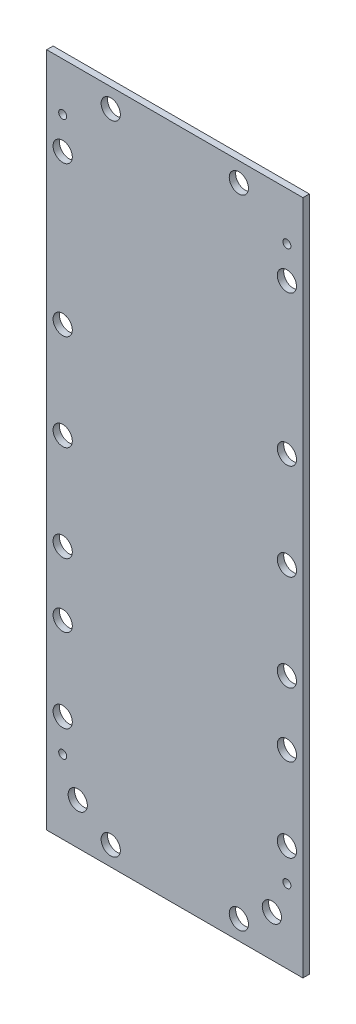
ISO-10303-21;
HEADER;
FILE_DESCRIPTION(('STEP AP214'),'2;1');
FILE_NAME('part.step','',(''),(''),'','','');
FILE_SCHEMA(('AUTOMOTIVE_DESIGN { 1 0 10303 214 1 1 1 1 }'));
ENDSEC;
DATA;
#1=APPLICATION_CONTEXT('core data for automotive mechanical design processes');
#2=APPLICATION_PROTOCOL_DEFINITION('international standard','automotive_design',2000,#1);
#3=PRODUCT_CONTEXT('',#1,'mechanical');
#4=PRODUCT('Part','Part','',(#3));
#5=PRODUCT_RELATED_PRODUCT_CATEGORY('part','',(#4));
#6=PRODUCT_DEFINITION_FORMATION('','',#4);
#7=PRODUCT_DEFINITION_CONTEXT('part definition',#1,'design');
#8=PRODUCT_DEFINITION('design','',#6,#7);
#9=PRODUCT_DEFINITION_SHAPE('','',#8);
#10=(LENGTH_UNIT() NAMED_UNIT(*) SI_UNIT(.MILLI.,.METRE.));
#11=(NAMED_UNIT(*) PLANE_ANGLE_UNIT() SI_UNIT($,.RADIAN.));
#12=(NAMED_UNIT(*) SI_UNIT($,.STERADIAN.) SOLID_ANGLE_UNIT());
#13=UNCERTAINTY_MEASURE_WITH_UNIT(LENGTH_MEASURE(1.E-05),#10,'distance_accuracy_value','');
#14=(GEOMETRIC_REPRESENTATION_CONTEXT(3) GLOBAL_UNCERTAINTY_ASSIGNED_CONTEXT((#13)) GLOBAL_UNIT_ASSIGNED_CONTEXT((#10,
#11,#12)) REPRESENTATION_CONTEXT('',''));
#15=CARTESIAN_POINT('',(0.,0.,0.));
#16=DIRECTION('',(0.,0.,1.));
#17=DIRECTION('',(1.,0.,0.));
#18=AXIS2_PLACEMENT_3D('',#15,#16,#17);
#19=CARTESIAN_POINT('',(80.,0.,2.));
#20=DIRECTION('',(0.,1.,0.));
#21=DIRECTION('',(0.,0.,1.));
#22=AXIS2_PLACEMENT_3D('',#19,#20,#21);
#23=PLANE('',#22);
#24=DIRECTION('',(1.,0.,0.));
#25=VECTOR('',#24,1.);
#26=CARTESIAN_POINT('',(80.,0.,0.));
#27=LINE('',#26,#25);
#28=CARTESIAN_POINT('',(0.,0.,0.));
#29=VERTEX_POINT('',#28);
#30=CARTESIAN_POINT('',(80.,0.,0.));
#31=VERTEX_POINT('',#30);
#32=EDGE_CURVE('E104',#29,#31,#27,.T.);
#33=ORIENTED_EDGE('',*,*,#32,.T.);
#34=DIRECTION('',(0.,0.,-1.));
#35=VECTOR('',#34,1.);
#36=CARTESIAN_POINT('',(80.,0.,2.));
#37=LINE('',#36,#35);
#38=CARTESIAN_POINT('',(80.,0.,2.));
#39=VERTEX_POINT('',#38);
#40=EDGE_CURVE('E11',#39,#31,#37,.T.);
#41=ORIENTED_EDGE('',*,*,#40,.F.);
#42=DIRECTION('',(1.,0.,0.));
#43=VECTOR('',#42,1.);
#44=CARTESIAN_POINT('',(80.,0.,2.));
#45=LINE('',#44,#43);
#46=CARTESIAN_POINT('',(0.,0.,2.));
#47=VERTEX_POINT('',#46);
#48=EDGE_CURVE('E91',#47,#39,#45,.T.);
#49=ORIENTED_EDGE('',*,*,#48,.F.);
#50=DIRECTION('',(0.,0.,-1.));
#51=VECTOR('',#50,1.);
#52=CARTESIAN_POINT('',(0.,0.,2.));
#53=LINE('',#52,#51);
#54=EDGE_CURVE('E100',#47,#29,#53,.T.);
#55=ORIENTED_EDGE('',*,*,#54,.T.);
#56=EDGE_LOOP('',(#33,#41,#49,#55));
#57=FACE_BOUND('',#56,.T.);
#58=ADVANCED_FACE('F38',(#57),#23,.F.);
#59=CARTESIAN_POINT('',(80.,211.,2.));
#60=DIRECTION('',(-1.,0.,0.));
#61=DIRECTION('',(0.,0.,1.));
#62=AXIS2_PLACEMENT_3D('',#59,#60,#61);
#63=PLANE('',#62);
#64=DIRECTION('',(0.,1.,0.));
#65=VECTOR('',#64,1.);
#66=CARTESIAN_POINT('',(80.,211.,0.));
#67=LINE('',#66,#65);
#68=CARTESIAN_POINT('',(80.,211.,0.));
#69=VERTEX_POINT('',#68);
#70=EDGE_CURVE('E95',#31,#69,#67,.T.);
#71=ORIENTED_EDGE('',*,*,#70,.T.);
#72=DIRECTION('',(0.,0.,-1.));
#73=VECTOR('',#72,1.);
#74=CARTESIAN_POINT('',(80.,211.,2.));
#75=LINE('',#74,#73);
#76=CARTESIAN_POINT('',(80.,211.,2.));
#77=VERTEX_POINT('',#76);
#78=EDGE_CURVE('E47',#77,#69,#75,.T.);
#79=ORIENTED_EDGE('',*,*,#78,.F.);
#80=DIRECTION('',(0.,1.,0.));
#81=VECTOR('',#80,1.);
#82=CARTESIAN_POINT('',(80.,211.,2.));
#83=LINE('',#82,#81);
#84=EDGE_CURVE('E86',#39,#77,#83,.T.);
#85=ORIENTED_EDGE('',*,*,#84,.F.);
#86=ORIENTED_EDGE('',*,*,#40,.T.);
#87=EDGE_LOOP('',(#71,#79,#85,#86));
#88=FACE_BOUND('',#87,.T.);
#89=ADVANCED_FACE('F94',(#88),#63,.F.);
#90=CARTESIAN_POINT('',(0.,211.,2.));
#91=DIRECTION('',(0.,-1.,0.));
#92=DIRECTION('',(0.,0.,-1.));
#93=AXIS2_PLACEMENT_3D('',#90,#91,#92);
#94=PLANE('',#93);
#95=DIRECTION('',(-1.,0.,0.));
#96=VECTOR('',#95,1.);
#97=CARTESIAN_POINT('',(0.,211.,0.));
#98=LINE('',#97,#96);
#99=CARTESIAN_POINT('',(0.,211.,0.));
#100=VERTEX_POINT('',#99);
#101=EDGE_CURVE('E73',#69,#100,#98,.T.);
#102=ORIENTED_EDGE('',*,*,#101,.T.);
#103=DIRECTION('',(0.,0.,-1.));
#104=VECTOR('',#103,1.);
#105=CARTESIAN_POINT('',(0.,211.,2.));
#106=LINE('',#105,#104);
#107=CARTESIAN_POINT('',(0.,211.,2.));
#108=VERTEX_POINT('',#107);
#109=EDGE_CURVE('E96',#108,#100,#106,.T.);
#110=ORIENTED_EDGE('',*,*,#109,.F.);
#111=DIRECTION('',(-1.,0.,0.));
#112=VECTOR('',#111,1.);
#113=CARTESIAN_POINT('',(0.,211.,2.));
#114=LINE('',#113,#112);
#115=EDGE_CURVE('E89',#77,#108,#114,.T.);
#116=ORIENTED_EDGE('',*,*,#115,.F.);
#117=ORIENTED_EDGE('',*,*,#78,.T.);
#118=EDGE_LOOP('',(#102,#110,#116,#117));
#119=FACE_BOUND('',#118,.T.);
#120=ADVANCED_FACE('F98',(#119),#94,.F.);
#121=CARTESIAN_POINT('',(0.,0.,2.));
#122=DIRECTION('',(1.,0.,0.));
#123=DIRECTION('',(0.,0.,-1.));
#124=AXIS2_PLACEMENT_3D('',#121,#122,#123);
#125=PLANE('',#124);
#126=DIRECTION('',(0.,-1.,0.));
#127=VECTOR('',#126,1.);
#128=CARTESIAN_POINT('',(0.,0.,0.));
#129=LINE('',#128,#127);
#130=EDGE_CURVE('E79',#100,#29,#129,.T.);
#131=ORIENTED_EDGE('',*,*,#130,.T.);
#132=ORIENTED_EDGE('',*,*,#54,.F.);
#133=DIRECTION('',(0.,-1.,0.));
#134=VECTOR('',#133,1.);
#135=CARTESIAN_POINT('',(0.,0.,2.));
#136=LINE('',#135,#134);
#137=EDGE_CURVE('E56',#108,#47,#136,.T.);
#138=ORIENTED_EDGE('',*,*,#137,.F.);
#139=ORIENTED_EDGE('',*,*,#109,.T.);
#140=EDGE_LOOP('',(#131,#132,#138,#139));
#141=FACE_BOUND('',#140,.T.);
#142=ADVANCED_FACE('F156',(#141),#125,.F.);
#143=CARTESIAN_POINT('',(0.,0.,2.));
#144=DIRECTION('',(0.,0.,-1.));
#145=DIRECTION('',(-1.,0.,0.));
#146=AXIS2_PLACEMENT_3D('',#143,#144,#145);
#147=PLANE('',#146);
#148=CARTESIAN_POINT('',(20.,205.,2.));
#149=DIRECTION('',(0.,0.,-1.));
#150=DIRECTION('',(-1.,0.,0.));
#151=AXIS2_PLACEMENT_3D('',#148,#149,#150);
#152=CIRCLE('',#151,3.);
#153=CARTESIAN_POINT('',(17.,205.,2.));
#154=VERTEX_POINT('',#153);
#155=EDGE_CURVE('E407',#154,#154,#152,.F.);
#156=ORIENTED_EDGE('',*,*,#155,.F.);
#157=EDGE_LOOP('',(#156));
#158=FACE_BOUND('',#157,.T.);
#159=CARTESIAN_POINT('',(4.99999999999998,33.2,2.));
#160=DIRECTION('',(0.,0.,-1.));
#161=DIRECTION('',(-1.,0.,0.));
#162=AXIS2_PLACEMENT_3D('',#159,#160,#161);
#163=CIRCLE('',#162,3.);
#164=CARTESIAN_POINT('',(1.99999999999998,33.2,2.));
#165=VERTEX_POINT('',#164);
#166=EDGE_CURVE('E419',#165,#165,#163,.F.);
#167=ORIENTED_EDGE('',*,*,#166,.F.);
#168=EDGE_LOOP('',(#167));
#169=FACE_BOUND('',#168,.T.);
#170=CARTESIAN_POINT('',(4.99999999999999,59.2,2.));
#171=DIRECTION('',(0.,0.,-1.));
#172=DIRECTION('',(-1.,0.,0.));
#173=AXIS2_PLACEMENT_3D('',#170,#171,#172);
#174=CIRCLE('',#173,3.);
#175=CARTESIAN_POINT('',(1.99999999999998,59.2,2.));
#176=VERTEX_POINT('',#175);
#177=EDGE_CURVE('E426',#176,#176,#174,.F.);
#178=ORIENTED_EDGE('',*,*,#177,.F.);
#179=EDGE_LOOP('',(#178));
#180=FACE_BOUND('',#179,.T.);
#181=CARTESIAN_POINT('',(5.00000000000002,79.2,2.));
#182=DIRECTION('',(0.,0.,-1.));
#183=DIRECTION('',(-1.,0.,0.));
#184=AXIS2_PLACEMENT_3D('',#181,#182,#183);
#185=CIRCLE('',#184,3.);
#186=CARTESIAN_POINT('',(2.00000000000001,79.2,2.));
#187=VERTEX_POINT('',#186);
#188=EDGE_CURVE('E425',#187,#187,#185,.F.);
#189=ORIENTED_EDGE('',*,*,#188,.F.);
#190=EDGE_LOOP('',(#189));
#191=FACE_BOUND('',#190,.T.);
#192=CARTESIAN_POINT('',(60.,5.99999999999999,2.));
#193=DIRECTION('',(0.,0.,-1.));
#194=DIRECTION('',(-1.,0.,0.));
#195=AXIS2_PLACEMENT_3D('',#192,#193,#194);
#196=CIRCLE('',#195,3.);
#197=CARTESIAN_POINT('',(57.,5.99999999999999,2.));
#198=VERTEX_POINT('',#197);
#199=EDGE_CURVE('E411',#198,#198,#196,.F.);
#200=ORIENTED_EDGE('',*,*,#199,.F.);
#201=EDGE_LOOP('',(#200));
#202=FACE_BOUND('',#201,.T.);
#203=CARTESIAN_POINT('',(20.,5.99999999999999,2.));
#204=DIRECTION('',(0.,0.,-1.));
#205=DIRECTION('',(-1.,0.,0.));
#206=AXIS2_PLACEMENT_3D('',#203,#204,#205);
#207=CIRCLE('',#206,2.99999999999999);
#208=CARTESIAN_POINT('',(17.,5.99999999999999,2.));
#209=VERTEX_POINT('',#208);
#210=EDGE_CURVE('E535',#209,#209,#207,.F.);
#211=ORIENTED_EDGE('',*,*,#210,.F.);
#212=EDGE_LOOP('',(#211));
#213=FACE_BOUND('',#212,.T.);
#214=CARTESIAN_POINT('',(70.3,13.,2.));
#215=DIRECTION('',(0.,0.,-1.));
#216=DIRECTION('',(-1.,0.,0.));
#217=AXIS2_PLACEMENT_3D('',#214,#215,#216);
#218=CIRCLE('',#217,3.00000000000001);
#219=CARTESIAN_POINT('',(67.3,13.,2.));
#220=VERTEX_POINT('',#219);
#221=EDGE_CURVE('E540',#220,#220,#218,.F.);
#222=ORIENTED_EDGE('',*,*,#221,.F.);
#223=EDGE_LOOP('',(#222));
#224=FACE_BOUND('',#223,.T.);
#225=CARTESIAN_POINT('',(60.,205.,2.));
#226=DIRECTION('',(0.,0.,-1.));
#227=DIRECTION('',(-1.,0.,0.));
#228=AXIS2_PLACEMENT_3D('',#225,#226,#227);
#229=CIRCLE('',#228,3.);
#230=CARTESIAN_POINT('',(57.,205.,2.));
#231=VERTEX_POINT('',#230);
#232=EDGE_CURVE('E529',#231,#231,#229,.F.);
#233=ORIENTED_EDGE('',*,*,#232,.F.);
#234=EDGE_LOOP('',(#233));
#235=FACE_BOUND('',#234,.T.);
#236=CARTESIAN_POINT('',(75.,139.2,2.));
#237=DIRECTION('',(0.,0.,-1.));
#238=DIRECTION('',(-1.,0.,0.));
#239=AXIS2_PLACEMENT_3D('',#236,#237,#238);
#240=CIRCLE('',#239,3.00000000000001);
#241=CARTESIAN_POINT('',(72.,139.2,2.));
#242=VERTEX_POINT('',#241);
#243=EDGE_CURVE('E462',#242,#242,#240,.F.);
#244=ORIENTED_EDGE('',*,*,#243,.F.);
#245=EDGE_LOOP('',(#244));
#246=FACE_BOUND('',#245,.T.);
#247=CARTESIAN_POINT('',(75.,109.2,2.));
#248=DIRECTION('',(0.,0.,-1.));
#249=DIRECTION('',(-1.,0.,0.));
#250=AXIS2_PLACEMENT_3D('',#247,#248,#249);
#251=CIRCLE('',#250,3.00000000000001);
#252=CARTESIAN_POINT('',(72.,109.2,2.));
#253=VERTEX_POINT('',#252);
#254=EDGE_CURVE('E463',#253,#253,#251,.F.);
#255=ORIENTED_EDGE('',*,*,#254,.F.);
#256=EDGE_LOOP('',(#255));
#257=FACE_BOUND('',#256,.T.);
#258=CARTESIAN_POINT('',(75.,79.2,2.));
#259=DIRECTION('',(0.,0.,-1.));
#260=DIRECTION('',(-1.,0.,0.));
#261=AXIS2_PLACEMENT_3D('',#258,#259,#260);
#262=CIRCLE('',#261,3.00000000000001);
#263=CARTESIAN_POINT('',(72.,79.2,2.));
#264=VERTEX_POINT('',#263);
#265=EDGE_CURVE('E470',#264,#264,#262,.F.);
#266=ORIENTED_EDGE('',*,*,#265,.F.);
#267=EDGE_LOOP('',(#266));
#268=FACE_BOUND('',#267,.T.);
#269=CARTESIAN_POINT('',(75.,59.2,2.));
#270=DIRECTION('',(0.,0.,-1.));
#271=DIRECTION('',(-1.,0.,0.));
#272=AXIS2_PLACEMENT_3D('',#269,#270,#271);
#273=CIRCLE('',#272,3.00000000000001);
#274=CARTESIAN_POINT('',(72.,59.2,2.));
#275=VERTEX_POINT('',#274);
#276=EDGE_CURVE('E476',#275,#275,#273,.F.);
#277=ORIENTED_EDGE('',*,*,#276,.F.);
#278=EDGE_LOOP('',(#277));
#279=FACE_BOUND('',#278,.T.);
#280=CARTESIAN_POINT('',(5.00000000000002,109.2,2.));
#281=DIRECTION('',(0.,0.,-1.));
#282=DIRECTION('',(-1.,0.,0.));
#283=AXIS2_PLACEMENT_3D('',#280,#281,#282);
#284=CIRCLE('',#283,3.);
#285=CARTESIAN_POINT('',(2.00000000000002,109.2,2.));
#286=VERTEX_POINT('',#285);
#287=EDGE_CURVE('E439',#286,#286,#284,.F.);
#288=ORIENTED_EDGE('',*,*,#287,.F.);
#289=EDGE_LOOP('',(#288));
#290=FACE_BOUND('',#289,.T.);
#291=CARTESIAN_POINT('',(5.00000000000002,139.2,2.));
#292=DIRECTION('',(0.,0.,-1.));
#293=DIRECTION('',(-1.,0.,0.));
#294=AXIS2_PLACEMENT_3D('',#291,#292,#293);
#295=CIRCLE('',#294,3.);
#296=CARTESIAN_POINT('',(2.00000000000002,139.2,2.));
#297=VERTEX_POINT('',#296);
#298=EDGE_CURVE('E438',#297,#297,#295,.F.);
#299=ORIENTED_EDGE('',*,*,#298,.F.);
#300=EDGE_LOOP('',(#299));
#301=FACE_BOUND('',#300,.T.);
#302=CARTESIAN_POINT('',(5.00000000000003,186.,2.));
#303=DIRECTION('',(0.,0.,-1.));
#304=DIRECTION('',(-1.,0.,0.));
#305=AXIS2_PLACEMENT_3D('',#302,#303,#304);
#306=CIRCLE('',#305,3.);
#307=CARTESIAN_POINT('',(2.00000000000003,186.,2.));
#308=VERTEX_POINT('',#307);
#309=EDGE_CURVE('E451',#308,#308,#306,.F.);
#310=ORIENTED_EDGE('',*,*,#309,.F.);
#311=EDGE_LOOP('',(#310));
#312=FACE_BOUND('',#311,.T.);
#313=CARTESIAN_POINT('',(75.,33.2,2.));
#314=DIRECTION('',(0.,0.,-1.));
#315=DIRECTION('',(-1.,0.,0.));
#316=AXIS2_PLACEMENT_3D('',#313,#314,#315);
#317=CIRCLE('',#316,3.00000000000001);
#318=CARTESIAN_POINT('',(72.,33.2,2.));
#319=VERTEX_POINT('',#318);
#320=EDGE_CURVE('E450',#319,#319,#317,.F.);
#321=ORIENTED_EDGE('',*,*,#320,.F.);
#322=EDGE_LOOP('',(#321));
#323=FACE_BOUND('',#322,.T.);
#324=CARTESIAN_POINT('',(9.7,13.,2.));
#325=DIRECTION('',(0.,0.,-1.));
#326=DIRECTION('',(-1.,0.,0.));
#327=AXIS2_PLACEMENT_3D('',#324,#325,#326);
#328=CIRCLE('',#327,3.);
#329=CARTESIAN_POINT('',(6.7,13.,2.));
#330=VERTEX_POINT('',#329);
#331=EDGE_CURVE('E524',#330,#330,#328,.F.);
#332=ORIENTED_EDGE('',*,*,#331,.F.);
#333=EDGE_LOOP('',(#332));
#334=FACE_BOUND('',#333,.T.);
#335=CARTESIAN_POINT('',(75.,186.,2.));
#336=DIRECTION('',(0.,0.,-1.));
#337=DIRECTION('',(-1.,0.,0.));
#338=AXIS2_PLACEMENT_3D('',#335,#336,#337);
#339=CIRCLE('',#338,3.00000000000001);
#340=CARTESIAN_POINT('',(72.,186.,2.));
#341=VERTEX_POINT('',#340);
#342=EDGE_CURVE('E485',#341,#341,#339,.F.);
#343=ORIENTED_EDGE('',*,*,#342,.F.);
#344=EDGE_LOOP('',(#343));
#345=FACE_BOUND('',#344,.T.);
#346=CARTESIAN_POINT('',(75.,196.,2.));
#347=DIRECTION('',(0.,0.,-1.));
#348=DIRECTION('',(-1.,0.,0.));
#349=AXIS2_PLACEMENT_3D('',#346,#347,#348);
#350=CIRCLE('',#349,1.25);
#351=CARTESIAN_POINT('',(73.75,196.,2.));
#352=VERTEX_POINT('',#351);
#353=EDGE_CURVE('E41',#352,#352,#350,.T.);
#354=ORIENTED_EDGE('',*,*,#353,.T.);
#355=EDGE_LOOP('',(#354));
#356=FACE_BOUND('',#355,.T.);
#357=CARTESIAN_POINT('',(5.00000000000003,196.,2.));
#358=DIRECTION('',(0.,0.,-1.));
#359=DIRECTION('',(-1.,0.,0.));
#360=AXIS2_PLACEMENT_3D('',#357,#358,#359);
#361=CIRCLE('',#360,1.25);
#362=CARTESIAN_POINT('',(3.75000000000003,196.,2.));
#363=VERTEX_POINT('',#362);
#364=EDGE_CURVE('E121',#363,#363,#361,.T.);
#365=ORIENTED_EDGE('',*,*,#364,.T.);
#366=EDGE_LOOP('',(#365));
#367=FACE_BOUND('',#366,.T.);
#368=CARTESIAN_POINT('',(75.,23.,2.));
#369=DIRECTION('',(0.,0.,-1.));
#370=DIRECTION('',(-1.,0.,0.));
#371=AXIS2_PLACEMENT_3D('',#368,#369,#370);
#372=CIRCLE('',#371,1.25);
#373=CARTESIAN_POINT('',(73.75,23.,2.));
#374=VERTEX_POINT('',#373);
#375=EDGE_CURVE('E112',#374,#374,#372,.T.);
#376=ORIENTED_EDGE('',*,*,#375,.T.);
#377=EDGE_LOOP('',(#376));
#378=FACE_BOUND('',#377,.T.);
#379=CARTESIAN_POINT('',(5.00000000000003,23.,2.));
#380=DIRECTION('',(0.,0.,-1.));
#381=DIRECTION('',(-1.,0.,0.));
#382=AXIS2_PLACEMENT_3D('',#379,#380,#381);
#383=CIRCLE('',#382,1.25);
#384=CARTESIAN_POINT('',(3.75000000000003,23.,2.));
#385=VERTEX_POINT('',#384);
#386=EDGE_CURVE('E107',#385,#385,#383,.T.);
#387=ORIENTED_EDGE('',*,*,#386,.T.);
#388=EDGE_LOOP('',(#387));
#389=FACE_BOUND('',#388,.T.);
#390=ORIENTED_EDGE('',*,*,#48,.T.);
#391=ORIENTED_EDGE('',*,*,#84,.T.);
#392=ORIENTED_EDGE('',*,*,#115,.T.);
#393=ORIENTED_EDGE('',*,*,#137,.T.);
#394=EDGE_LOOP('',(#390,#391,#392,#393));
#395=FACE_BOUND('',#394,.T.);
#396=ADVANCED_FACE('F87',(#158,#169,#180,#191,#202,#213,#224,#235,#246,#257,#268,#279,#290,#301,
#312,#323,#334,#345,#356,#367,#378,#389,#395),#147,.F.);
#397=CARTESIAN_POINT('',(0.,0.,0.));
#398=DIRECTION('',(0.,0.,-1.));
#399=DIRECTION('',(-1.,0.,0.));
#400=AXIS2_PLACEMENT_3D('',#397,#398,#399);
#401=PLANE('',#400);
#402=CARTESIAN_POINT('',(20.,205.,0.));
#403=DIRECTION('',(0.,0.,-1.));
#404=DIRECTION('',(-1.,0.,0.));
#405=AXIS2_PLACEMENT_3D('',#402,#403,#404);
#406=CIRCLE('',#405,3.);
#407=CARTESIAN_POINT('',(17.,205.,0.));
#408=VERTEX_POINT('',#407);
#409=EDGE_CURVE('E410',#408,#408,#406,.T.);
#410=ORIENTED_EDGE('',*,*,#409,.F.);
#411=EDGE_LOOP('',(#410));
#412=FACE_BOUND('',#411,.T.);
#413=CARTESIAN_POINT('',(4.99999999999998,33.2,0.));
#414=DIRECTION('',(0.,0.,-1.));
#415=DIRECTION('',(-1.,0.,0.));
#416=AXIS2_PLACEMENT_3D('',#413,#414,#415);
#417=CIRCLE('',#416,3.);
#418=CARTESIAN_POINT('',(1.99999999999998,33.2,0.));
#419=VERTEX_POINT('',#418);
#420=EDGE_CURVE('E413',#419,#419,#417,.T.);
#421=ORIENTED_EDGE('',*,*,#420,.F.);
#422=EDGE_LOOP('',(#421));
#423=FACE_BOUND('',#422,.T.);
#424=CARTESIAN_POINT('',(4.99999999999999,59.2,0.));
#425=DIRECTION('',(0.,0.,-1.));
#426=DIRECTION('',(-1.,0.,0.));
#427=AXIS2_PLACEMENT_3D('',#424,#425,#426);
#428=CIRCLE('',#427,3.);
#429=CARTESIAN_POINT('',(1.99999999999998,59.2,0.));
#430=VERTEX_POINT('',#429);
#431=EDGE_CURVE('E430',#430,#430,#428,.T.);
#432=ORIENTED_EDGE('',*,*,#431,.F.);
#433=EDGE_LOOP('',(#432));
#434=FACE_BOUND('',#433,.T.);
#435=CARTESIAN_POINT('',(5.00000000000002,79.2,0.));
#436=DIRECTION('',(0.,0.,-1.));
#437=DIRECTION('',(-1.,0.,0.));
#438=AXIS2_PLACEMENT_3D('',#435,#436,#437);
#439=CIRCLE('',#438,3.);
#440=CARTESIAN_POINT('',(2.00000000000001,79.2,0.));
#441=VERTEX_POINT('',#440);
#442=EDGE_CURVE('E422',#441,#441,#439,.T.);
#443=ORIENTED_EDGE('',*,*,#442,.F.);
#444=EDGE_LOOP('',(#443));
#445=FACE_BOUND('',#444,.T.);
#446=CARTESIAN_POINT('',(60.,5.99999999999999,0.));
#447=DIRECTION('',(0.,0.,-1.));
#448=DIRECTION('',(-1.,0.,0.));
#449=AXIS2_PLACEMENT_3D('',#446,#447,#448);
#450=CIRCLE('',#449,3.);
#451=CARTESIAN_POINT('',(57.,5.99999999999999,0.));
#452=VERTEX_POINT('',#451);
#453=EDGE_CURVE('E416',#452,#452,#450,.T.);
#454=ORIENTED_EDGE('',*,*,#453,.F.);
#455=EDGE_LOOP('',(#454));
#456=FACE_BOUND('',#455,.T.);
#457=CARTESIAN_POINT('',(20.,5.99999999999999,0.));
#458=DIRECTION('',(0.,0.,-1.));
#459=DIRECTION('',(-1.,0.,0.));
#460=AXIS2_PLACEMENT_3D('',#457,#458,#459);
#461=CIRCLE('',#460,2.99999999999999);
#462=CARTESIAN_POINT('',(17.,5.99999999999999,0.));
#463=VERTEX_POINT('',#462);
#464=EDGE_CURVE('E537',#463,#463,#461,.T.);
#465=ORIENTED_EDGE('',*,*,#464,.F.);
#466=EDGE_LOOP('',(#465));
#467=FACE_BOUND('',#466,.T.);
#468=CARTESIAN_POINT('',(70.3,13.,0.));
#469=DIRECTION('',(0.,0.,-1.));
#470=DIRECTION('',(-1.,0.,0.));
#471=AXIS2_PLACEMENT_3D('',#468,#469,#470);
#472=CIRCLE('',#471,3.00000000000001);
#473=CARTESIAN_POINT('',(67.3,13.,0.));
#474=VERTEX_POINT('',#473);
#475=EDGE_CURVE('E543',#474,#474,#472,.T.);
#476=ORIENTED_EDGE('',*,*,#475,.F.);
#477=EDGE_LOOP('',(#476));
#478=FACE_BOUND('',#477,.T.);
#479=CARTESIAN_POINT('',(60.,205.,0.));
#480=DIRECTION('',(0.,0.,-1.));
#481=DIRECTION('',(-1.,0.,0.));
#482=AXIS2_PLACEMENT_3D('',#479,#480,#481);
#483=CIRCLE('',#482,3.);
#484=CARTESIAN_POINT('',(57.,205.,0.));
#485=VERTEX_POINT('',#484);
#486=EDGE_CURVE('E525',#485,#485,#483,.T.);
#487=ORIENTED_EDGE('',*,*,#486,.F.);
#488=EDGE_LOOP('',(#487));
#489=FACE_BOUND('',#488,.T.);
#490=CARTESIAN_POINT('',(75.,139.2,0.));
#491=DIRECTION('',(0.,0.,-1.));
#492=DIRECTION('',(-1.,0.,0.));
#493=AXIS2_PLACEMENT_3D('',#490,#491,#492);
#494=CIRCLE('',#493,3.00000000000001);
#495=CARTESIAN_POINT('',(72.,139.2,0.));
#496=VERTEX_POINT('',#495);
#497=EDGE_CURVE('E459',#496,#496,#494,.T.);
#498=ORIENTED_EDGE('',*,*,#497,.F.);
#499=EDGE_LOOP('',(#498));
#500=FACE_BOUND('',#499,.T.);
#501=CARTESIAN_POINT('',(75.,109.2,0.));
#502=DIRECTION('',(0.,0.,-1.));
#503=DIRECTION('',(-1.,0.,0.));
#504=AXIS2_PLACEMENT_3D('',#501,#502,#503);
#505=CIRCLE('',#504,3.00000000000001);
#506=CARTESIAN_POINT('',(72.,109.2,0.));
#507=VERTEX_POINT('',#506);
#508=EDGE_CURVE('E467',#507,#507,#505,.T.);
#509=ORIENTED_EDGE('',*,*,#508,.F.);
#510=EDGE_LOOP('',(#509));
#511=FACE_BOUND('',#510,.T.);
#512=CARTESIAN_POINT('',(75.,79.2,0.));
#513=DIRECTION('',(0.,0.,-1.));
#514=DIRECTION('',(-1.,0.,0.));
#515=AXIS2_PLACEMENT_3D('',#512,#513,#514);
#516=CIRCLE('',#515,3.00000000000001);
#517=CARTESIAN_POINT('',(72.,79.2,0.));
#518=VERTEX_POINT('',#517);
#519=EDGE_CURVE('E473',#518,#518,#516,.T.);
#520=ORIENTED_EDGE('',*,*,#519,.F.);
#521=EDGE_LOOP('',(#520));
#522=FACE_BOUND('',#521,.T.);
#523=CARTESIAN_POINT('',(75.,59.2,0.));
#524=DIRECTION('',(0.,0.,-1.));
#525=DIRECTION('',(-1.,0.,0.));
#526=AXIS2_PLACEMENT_3D('',#523,#524,#525);
#527=CIRCLE('',#526,3.00000000000001);
#528=CARTESIAN_POINT('',(72.,59.2,0.));
#529=VERTEX_POINT('',#528);
#530=EDGE_CURVE('E454',#529,#529,#527,.T.);
#531=ORIENTED_EDGE('',*,*,#530,.F.);
#532=EDGE_LOOP('',(#531));
#533=FACE_BOUND('',#532,.T.);
#534=CARTESIAN_POINT('',(5.00000000000002,109.2,0.));
#535=DIRECTION('',(0.,0.,-1.));
#536=DIRECTION('',(-1.,0.,0.));
#537=AXIS2_PLACEMENT_3D('',#534,#535,#536);
#538=CIRCLE('',#537,3.);
#539=CARTESIAN_POINT('',(2.00000000000002,109.2,0.));
#540=VERTEX_POINT('',#539);
#541=EDGE_CURVE('E429',#540,#540,#538,.T.);
#542=ORIENTED_EDGE('',*,*,#541,.F.);
#543=EDGE_LOOP('',(#542));
#544=FACE_BOUND('',#543,.T.);
#545=CARTESIAN_POINT('',(5.00000000000002,139.2,0.));
#546=DIRECTION('',(0.,0.,-1.));
#547=DIRECTION('',(-1.,0.,0.));
#548=AXIS2_PLACEMENT_3D('',#545,#546,#547);
#549=CIRCLE('',#548,3.);
#550=CARTESIAN_POINT('',(2.00000000000002,139.2,0.));
#551=VERTEX_POINT('',#550);
#552=EDGE_CURVE('E435',#551,#551,#549,.T.);
#553=ORIENTED_EDGE('',*,*,#552,.F.);
#554=EDGE_LOOP('',(#553));
#555=FACE_BOUND('',#554,.T.);
#556=CARTESIAN_POINT('',(5.00000000000003,186.,0.));
#557=DIRECTION('',(0.,0.,-1.));
#558=DIRECTION('',(-1.,0.,0.));
#559=AXIS2_PLACEMENT_3D('',#556,#557,#558);
#560=CIRCLE('',#559,3.);
#561=CARTESIAN_POINT('',(2.00000000000003,186.,0.));
#562=VERTEX_POINT('',#561);
#563=EDGE_CURVE('E442',#562,#562,#560,.T.);
#564=ORIENTED_EDGE('',*,*,#563,.F.);
#565=EDGE_LOOP('',(#564));
#566=FACE_BOUND('',#565,.T.);
#567=CARTESIAN_POINT('',(75.,33.2,0.));
#568=DIRECTION('',(0.,0.,-1.));
#569=DIRECTION('',(-1.,0.,0.));
#570=AXIS2_PLACEMENT_3D('',#567,#568,#569);
#571=CIRCLE('',#570,3.00000000000001);
#572=CARTESIAN_POINT('',(72.,33.2,0.));
#573=VERTEX_POINT('',#572);
#574=EDGE_CURVE('E447',#573,#573,#571,.T.);
#575=ORIENTED_EDGE('',*,*,#574,.F.);
#576=EDGE_LOOP('',(#575));
#577=FACE_BOUND('',#576,.T.);
#578=CARTESIAN_POINT('',(9.7,13.,0.));
#579=DIRECTION('',(0.,0.,-1.));
#580=DIRECTION('',(-1.,0.,0.));
#581=AXIS2_PLACEMENT_3D('',#578,#579,#580);
#582=CIRCLE('',#581,3.);
#583=CARTESIAN_POINT('',(6.7,13.,0.));
#584=VERTEX_POINT('',#583);
#585=EDGE_CURVE('E526',#584,#584,#582,.T.);
#586=ORIENTED_EDGE('',*,*,#585,.F.);
#587=EDGE_LOOP('',(#586));
#588=FACE_BOUND('',#587,.T.);
#589=CARTESIAN_POINT('',(75.,186.,0.));
#590=DIRECTION('',(0.,0.,-1.));
#591=DIRECTION('',(-1.,0.,0.));
#592=AXIS2_PLACEMENT_3D('',#589,#590,#591);
#593=CIRCLE('',#592,3.00000000000001);
#594=CARTESIAN_POINT('',(72.,186.,0.));
#595=VERTEX_POINT('',#594);
#596=EDGE_CURVE('E466',#595,#595,#593,.T.);
#597=ORIENTED_EDGE('',*,*,#596,.F.);
#598=EDGE_LOOP('',(#597));
#599=FACE_BOUND('',#598,.T.);
#600=CARTESIAN_POINT('',(75.,196.,0.));
#601=DIRECTION('',(0.,0.,-1.));
#602=DIRECTION('',(-1.,0.,0.));
#603=AXIS2_PLACEMENT_3D('',#600,#601,#602);
#604=CIRCLE('',#603,1.25);
#605=CARTESIAN_POINT('',(73.75,196.,0.));
#606=VERTEX_POINT('',#605);
#607=EDGE_CURVE('E488',#606,#606,#604,.T.);
#608=ORIENTED_EDGE('',*,*,#607,.F.);
#609=EDGE_LOOP('',(#608));
#610=FACE_BOUND('',#609,.T.);
#611=CARTESIAN_POINT('',(5.00000000000003,196.,0.));
#612=DIRECTION('',(0.,0.,-1.));
#613=DIRECTION('',(-1.,0.,0.));
#614=AXIS2_PLACEMENT_3D('',#611,#612,#613);
#615=CIRCLE('',#614,1.25);
#616=CARTESIAN_POINT('',(3.75000000000003,196.,0.));
#617=VERTEX_POINT('',#616);
#618=EDGE_CURVE('E126',#617,#617,#615,.T.);
#619=ORIENTED_EDGE('',*,*,#618,.F.);
#620=EDGE_LOOP('',(#619));
#621=FACE_BOUND('',#620,.T.);
#622=CARTESIAN_POINT('',(75.,23.,0.));
#623=DIRECTION('',(0.,0.,-1.));
#624=DIRECTION('',(-1.,0.,0.));
#625=AXIS2_PLACEMENT_3D('',#622,#623,#624);
#626=CIRCLE('',#625,1.25);
#627=CARTESIAN_POINT('',(73.75,23.,0.));
#628=VERTEX_POINT('',#627);
#629=EDGE_CURVE('E115',#628,#628,#626,.T.);
#630=ORIENTED_EDGE('',*,*,#629,.F.);
#631=EDGE_LOOP('',(#630));
#632=FACE_BOUND('',#631,.T.);
#633=CARTESIAN_POINT('',(5.00000000000003,23.,0.));
#634=DIRECTION('',(0.,0.,-1.));
#635=DIRECTION('',(-1.,0.,0.));
#636=AXIS2_PLACEMENT_3D('',#633,#634,#635);
#637=CIRCLE('',#636,1.25);
#638=CARTESIAN_POINT('',(3.75000000000003,23.,0.));
#639=VERTEX_POINT('',#638);
#640=EDGE_CURVE('E114',#639,#639,#637,.T.);
#641=ORIENTED_EDGE('',*,*,#640,.F.);
#642=EDGE_LOOP('',(#641));
#643=FACE_BOUND('',#642,.T.);
#644=ORIENTED_EDGE('',*,*,#32,.F.);
#645=ORIENTED_EDGE('',*,*,#130,.F.);
#646=ORIENTED_EDGE('',*,*,#101,.F.);
#647=ORIENTED_EDGE('',*,*,#70,.F.);
#648=EDGE_LOOP('',(#644,#645,#646,#647));
#649=FACE_BOUND('',#648,.T.);
#650=ADVANCED_FACE('F137',(#412,#423,#434,#445,#456,#467,#478,#489,#500,#511,#522,#533,#544,
#555,#566,#577,#588,#599,#610,#621,#632,#643,#649),#401,.T.);
#651=CARTESIAN_POINT('',(5.00000000000003,23.,0.));
#652=DIRECTION('',(0.,0.,-1.));
#653=DIRECTION('',(-1.,0.,0.));
#654=AXIS2_PLACEMENT_3D('',#651,#652,#653);
#655=CYLINDRICAL_SURFACE('',#654,1.25);
#656=ORIENTED_EDGE('',*,*,#640,.T.);
#657=EDGE_LOOP('',(#656));
#658=FACE_BOUND('',#657,.T.);
#659=ORIENTED_EDGE('',*,*,#386,.F.);
#660=EDGE_LOOP('',(#659));
#661=FACE_BOUND('',#660,.T.);
#662=ADVANCED_FACE('F134',(#658,#661),#655,.F.);
#663=CARTESIAN_POINT('',(75.,23.,0.));
#664=DIRECTION('',(0.,0.,-1.));
#665=DIRECTION('',(-1.,0.,0.));
#666=AXIS2_PLACEMENT_3D('',#663,#664,#665);
#667=CYLINDRICAL_SURFACE('',#666,1.25);
#668=ORIENTED_EDGE('',*,*,#629,.T.);
#669=EDGE_LOOP('',(#668));
#670=FACE_BOUND('',#669,.T.);
#671=ORIENTED_EDGE('',*,*,#375,.F.);
#672=EDGE_LOOP('',(#671));
#673=FACE_BOUND('',#672,.T.);
#674=ADVANCED_FACE('F136',(#670,#673),#667,.F.);
#675=CARTESIAN_POINT('',(5.00000000000003,196.,0.));
#676=DIRECTION('',(0.,0.,-1.));
#677=DIRECTION('',(-1.,0.,0.));
#678=AXIS2_PLACEMENT_3D('',#675,#676,#677);
#679=CYLINDRICAL_SURFACE('',#678,1.25);
#680=ORIENTED_EDGE('',*,*,#618,.T.);
#681=EDGE_LOOP('',(#680));
#682=FACE_BOUND('',#681,.T.);
#683=ORIENTED_EDGE('',*,*,#364,.F.);
#684=EDGE_LOOP('',(#683));
#685=FACE_BOUND('',#684,.T.);
#686=ADVANCED_FACE('F144',(#682,#685),#679,.F.);
#687=CARTESIAN_POINT('',(75.,196.,0.));
#688=DIRECTION('',(0.,0.,-1.));
#689=DIRECTION('',(-1.,0.,0.));
#690=AXIS2_PLACEMENT_3D('',#687,#688,#689);
#691=CYLINDRICAL_SURFACE('',#690,1.25);
#692=ORIENTED_EDGE('',*,*,#607,.T.);
#693=EDGE_LOOP('',(#692));
#694=FACE_BOUND('',#693,.T.);
#695=ORIENTED_EDGE('',*,*,#353,.F.);
#696=EDGE_LOOP('',(#695));
#697=FACE_BOUND('',#696,.T.);
#698=ADVANCED_FACE('F212',(#694,#697),#691,.F.);
#699=CARTESIAN_POINT('',(75.,186.,10.4852813742386));
#700=DIRECTION('',(0.,0.,-1.));
#701=DIRECTION('',(-1.,0.,0.));
#702=AXIS2_PLACEMENT_3D('',#699,#700,#701);
#703=CYLINDRICAL_SURFACE('',#702,3.00000000000001);
#704=ORIENTED_EDGE('',*,*,#342,.T.);
#705=EDGE_LOOP('',(#704));
#706=FACE_BOUND('',#705,.T.);
#707=ORIENTED_EDGE('',*,*,#596,.T.);
#708=EDGE_LOOP('',(#707));
#709=FACE_BOUND('',#708,.T.);
#710=ADVANCED_FACE('F220',(#706,#709),#703,.F.);
#711=CARTESIAN_POINT('',(9.7,13.,10.4852813742386));
#712=DIRECTION('',(0.,0.,-1.));
#713=DIRECTION('',(-1.,0.,0.));
#714=AXIS2_PLACEMENT_3D('',#711,#712,#713);
#715=CYLINDRICAL_SURFACE('',#714,3.);
#716=ORIENTED_EDGE('',*,*,#331,.T.);
#717=EDGE_LOOP('',(#716));
#718=FACE_BOUND('',#717,.T.);
#719=ORIENTED_EDGE('',*,*,#585,.T.);
#720=EDGE_LOOP('',(#719));
#721=FACE_BOUND('',#720,.T.);
#722=ADVANCED_FACE('F228',(#718,#721),#715,.F.);
#723=CARTESIAN_POINT('',(75.,33.2,10.4852813742386));
#724=DIRECTION('',(0.,0.,-1.));
#725=DIRECTION('',(-1.,0.,0.));
#726=AXIS2_PLACEMENT_3D('',#723,#724,#725);
#727=CYLINDRICAL_SURFACE('',#726,3.00000000000001);
#728=ORIENTED_EDGE('',*,*,#320,.T.);
#729=EDGE_LOOP('',(#728));
#730=FACE_BOUND('',#729,.T.);
#731=ORIENTED_EDGE('',*,*,#574,.T.);
#732=EDGE_LOOP('',(#731));
#733=FACE_BOUND('',#732,.T.);
#734=ADVANCED_FACE('F237',(#730,#733),#727,.F.);
#735=CARTESIAN_POINT('',(5.00000000000003,186.,10.4852813742386));
#736=DIRECTION('',(0.,0.,-1.));
#737=DIRECTION('',(-1.,0.,0.));
#738=AXIS2_PLACEMENT_3D('',#735,#736,#737);
#739=CYLINDRICAL_SURFACE('',#738,3.);
#740=ORIENTED_EDGE('',*,*,#309,.T.);
#741=EDGE_LOOP('',(#740));
#742=FACE_BOUND('',#741,.T.);
#743=ORIENTED_EDGE('',*,*,#563,.T.);
#744=EDGE_LOOP('',(#743));
#745=FACE_BOUND('',#744,.T.);
#746=ADVANCED_FACE('F246',(#742,#745),#739,.F.);
#747=CARTESIAN_POINT('',(5.00000000000002,139.2,10.4852813742386));
#748=DIRECTION('',(0.,0.,-1.));
#749=DIRECTION('',(-1.,0.,0.));
#750=AXIS2_PLACEMENT_3D('',#747,#748,#749);
#751=CYLINDRICAL_SURFACE('',#750,3.);
#752=ORIENTED_EDGE('',*,*,#298,.T.);
#753=EDGE_LOOP('',(#752));
#754=FACE_BOUND('',#753,.T.);
#755=ORIENTED_EDGE('',*,*,#552,.T.);
#756=EDGE_LOOP('',(#755));
#757=FACE_BOUND('',#756,.T.);
#758=ADVANCED_FACE('F255',(#754,#757),#751,.F.);
#759=CARTESIAN_POINT('',(5.00000000000002,109.2,10.4852813742386));
#760=DIRECTION('',(0.,0.,-1.));
#761=DIRECTION('',(-1.,0.,0.));
#762=AXIS2_PLACEMENT_3D('',#759,#760,#761);
#763=CYLINDRICAL_SURFACE('',#762,3.);
#764=ORIENTED_EDGE('',*,*,#287,.T.);
#765=EDGE_LOOP('',(#764));
#766=FACE_BOUND('',#765,.T.);
#767=ORIENTED_EDGE('',*,*,#541,.T.);
#768=EDGE_LOOP('',(#767));
#769=FACE_BOUND('',#768,.T.);
#770=ADVANCED_FACE('F264',(#766,#769),#763,.F.);
#771=CARTESIAN_POINT('',(75.,59.2,10.4852813742386));
#772=DIRECTION('',(0.,0.,-1.));
#773=DIRECTION('',(-1.,0.,0.));
#774=AXIS2_PLACEMENT_3D('',#771,#772,#773);
#775=CYLINDRICAL_SURFACE('',#774,3.00000000000001);
#776=ORIENTED_EDGE('',*,*,#276,.T.);
#777=EDGE_LOOP('',(#776));
#778=FACE_BOUND('',#777,.T.);
#779=ORIENTED_EDGE('',*,*,#530,.T.);
#780=EDGE_LOOP('',(#779));
#781=FACE_BOUND('',#780,.T.);
#782=ADVANCED_FACE('F273',(#778,#781),#775,.F.);
#783=CARTESIAN_POINT('',(75.,79.2,10.4852813742386));
#784=DIRECTION('',(0.,0.,-1.));
#785=DIRECTION('',(-1.,0.,0.));
#786=AXIS2_PLACEMENT_3D('',#783,#784,#785);
#787=CYLINDRICAL_SURFACE('',#786,3.00000000000001);
#788=ORIENTED_EDGE('',*,*,#265,.T.);
#789=EDGE_LOOP('',(#788));
#790=FACE_BOUND('',#789,.T.);
#791=ORIENTED_EDGE('',*,*,#519,.T.);
#792=EDGE_LOOP('',(#791));
#793=FACE_BOUND('',#792,.T.);
#794=ADVANCED_FACE('F282',(#790,#793),#787,.F.);
#795=CARTESIAN_POINT('',(75.,109.2,10.4852813742386));
#796=DIRECTION('',(0.,0.,-1.));
#797=DIRECTION('',(-1.,0.,0.));
#798=AXIS2_PLACEMENT_3D('',#795,#796,#797);
#799=CYLINDRICAL_SURFACE('',#798,3.00000000000001);
#800=ORIENTED_EDGE('',*,*,#254,.T.);
#801=EDGE_LOOP('',(#800));
#802=FACE_BOUND('',#801,.T.);
#803=ORIENTED_EDGE('',*,*,#508,.T.);
#804=EDGE_LOOP('',(#803));
#805=FACE_BOUND('',#804,.T.);
#806=ADVANCED_FACE('F291',(#802,#805),#799,.F.);
#807=CARTESIAN_POINT('',(75.,139.2,10.4852813742386));
#808=DIRECTION('',(0.,0.,-1.));
#809=DIRECTION('',(-1.,0.,0.));
#810=AXIS2_PLACEMENT_3D('',#807,#808,#809);
#811=CYLINDRICAL_SURFACE('',#810,3.00000000000001);
#812=ORIENTED_EDGE('',*,*,#243,.T.);
#813=EDGE_LOOP('',(#812));
#814=FACE_BOUND('',#813,.T.);
#815=ORIENTED_EDGE('',*,*,#497,.T.);
#816=EDGE_LOOP('',(#815));
#817=FACE_BOUND('',#816,.T.);
#818=ADVANCED_FACE('F300',(#814,#817),#811,.F.);
#819=CARTESIAN_POINT('',(60.,205.,10.4852813742386));
#820=DIRECTION('',(0.,0.,-1.));
#821=DIRECTION('',(-1.,0.,0.));
#822=AXIS2_PLACEMENT_3D('',#819,#820,#821);
#823=CYLINDRICAL_SURFACE('',#822,3.);
#824=ORIENTED_EDGE('',*,*,#232,.T.);
#825=EDGE_LOOP('',(#824));
#826=FACE_BOUND('',#825,.T.);
#827=ORIENTED_EDGE('',*,*,#486,.T.);
#828=EDGE_LOOP('',(#827));
#829=FACE_BOUND('',#828,.T.);
#830=ADVANCED_FACE('F309',(#826,#829),#823,.F.);
#831=CARTESIAN_POINT('',(70.3,13.,10.4852813742386));
#832=DIRECTION('',(0.,0.,-1.));
#833=DIRECTION('',(-1.,0.,0.));
#834=AXIS2_PLACEMENT_3D('',#831,#832,#833);
#835=CYLINDRICAL_SURFACE('',#834,3.00000000000001);
#836=ORIENTED_EDGE('',*,*,#221,.T.);
#837=EDGE_LOOP('',(#836));
#838=FACE_BOUND('',#837,.T.);
#839=ORIENTED_EDGE('',*,*,#475,.T.);
#840=EDGE_LOOP('',(#839));
#841=FACE_BOUND('',#840,.T.);
#842=ADVANCED_FACE('F318',(#838,#841),#835,.F.);
#843=CARTESIAN_POINT('',(20.,5.99999999999999,10.4852813742386));
#844=DIRECTION('',(0.,0.,-1.));
#845=DIRECTION('',(-1.,0.,0.));
#846=AXIS2_PLACEMENT_3D('',#843,#844,#845);
#847=CYLINDRICAL_SURFACE('',#846,2.99999999999999);
#848=ORIENTED_EDGE('',*,*,#210,.T.);
#849=EDGE_LOOP('',(#848));
#850=FACE_BOUND('',#849,.T.);
#851=ORIENTED_EDGE('',*,*,#464,.T.);
#852=EDGE_LOOP('',(#851));
#853=FACE_BOUND('',#852,.T.);
#854=ADVANCED_FACE('F327',(#850,#853),#847,.F.);
#855=CARTESIAN_POINT('',(60.,5.99999999999999,10.4852813742386));
#856=DIRECTION('',(0.,0.,-1.));
#857=DIRECTION('',(-1.,0.,0.));
#858=AXIS2_PLACEMENT_3D('',#855,#856,#857);
#859=CYLINDRICAL_SURFACE('',#858,3.);
#860=ORIENTED_EDGE('',*,*,#199,.T.);
#861=EDGE_LOOP('',(#860));
#862=FACE_BOUND('',#861,.T.);
#863=ORIENTED_EDGE('',*,*,#453,.T.);
#864=EDGE_LOOP('',(#863));
#865=FACE_BOUND('',#864,.T.);
#866=ADVANCED_FACE('F336',(#862,#865),#859,.F.);
#867=CARTESIAN_POINT('',(5.00000000000002,79.2,10.4852813742386));
#868=DIRECTION('',(0.,0.,-1.));
#869=DIRECTION('',(-1.,0.,0.));
#870=AXIS2_PLACEMENT_3D('',#867,#868,#869);
#871=CYLINDRICAL_SURFACE('',#870,3.);
#872=ORIENTED_EDGE('',*,*,#188,.T.);
#873=EDGE_LOOP('',(#872));
#874=FACE_BOUND('',#873,.T.);
#875=ORIENTED_EDGE('',*,*,#442,.T.);
#876=EDGE_LOOP('',(#875));
#877=FACE_BOUND('',#876,.T.);
#878=ADVANCED_FACE('F345',(#874,#877),#871,.F.);
#879=CARTESIAN_POINT('',(4.99999999999999,59.2,10.4852813742386));
#880=DIRECTION('',(0.,0.,-1.));
#881=DIRECTION('',(-1.,0.,0.));
#882=AXIS2_PLACEMENT_3D('',#879,#880,#881);
#883=CYLINDRICAL_SURFACE('',#882,3.);
#884=ORIENTED_EDGE('',*,*,#177,.T.);
#885=EDGE_LOOP('',(#884));
#886=FACE_BOUND('',#885,.T.);
#887=ORIENTED_EDGE('',*,*,#431,.T.);
#888=EDGE_LOOP('',(#887));
#889=FACE_BOUND('',#888,.T.);
#890=ADVANCED_FACE('F354',(#886,#889),#883,.F.);
#891=CARTESIAN_POINT('',(4.99999999999998,33.2,10.4852813742386));
#892=DIRECTION('',(0.,0.,-1.));
#893=DIRECTION('',(-1.,0.,0.));
#894=AXIS2_PLACEMENT_3D('',#891,#892,#893);
#895=CYLINDRICAL_SURFACE('',#894,3.);
#896=ORIENTED_EDGE('',*,*,#166,.T.);
#897=EDGE_LOOP('',(#896));
#898=FACE_BOUND('',#897,.T.);
#899=ORIENTED_EDGE('',*,*,#420,.T.);
#900=EDGE_LOOP('',(#899));
#901=FACE_BOUND('',#900,.T.);
#902=ADVANCED_FACE('F363',(#898,#901),#895,.F.);
#903=CARTESIAN_POINT('',(20.,205.,10.4852813742386));
#904=DIRECTION('',(0.,0.,-1.));
#905=DIRECTION('',(-1.,0.,0.));
#906=AXIS2_PLACEMENT_3D('',#903,#904,#905);
#907=CYLINDRICAL_SURFACE('',#906,3.);
#908=ORIENTED_EDGE('',*,*,#155,.T.);
#909=EDGE_LOOP('',(#908));
#910=FACE_BOUND('',#909,.T.);
#911=ORIENTED_EDGE('',*,*,#409,.T.);
#912=EDGE_LOOP('',(#911));
#913=FACE_BOUND('',#912,.T.);
#914=ADVANCED_FACE('F372',(#910,#913),#907,.F.);
#915=CLOSED_SHELL('',(#58,#89,#120,#142,#396,#650,#662,#674,#686,#698,#710,#722,#734,#746,#758,
#770,#782,#794,#806,#818,#830,#842,#854,#866,#878,#890,#902,#914));
#916=MANIFOLD_SOLID_BREP('B2',#915);
#917=ADVANCED_BREP_SHAPE_REPRESENTATION('',(#18,#916),#14);
#918=SHAPE_DEFINITION_REPRESENTATION(#9,#917);
ENDSEC;
END-ISO-10303-21;
